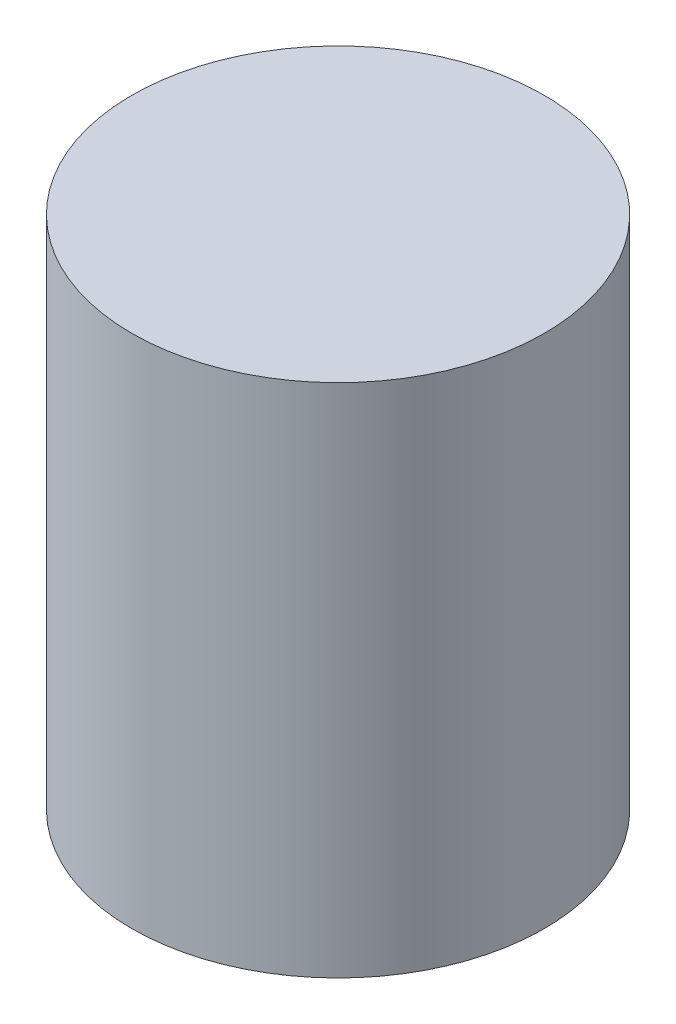
ISO-10303-21;
HEADER;
FILE_DESCRIPTION(('STEP AP214'),'2;1');
FILE_NAME('part.step','',(''),(''),'','','');
FILE_SCHEMA(('AUTOMOTIVE_DESIGN { 1 0 10303 214 1 1 1 1 }'));
ENDSEC;
DATA;
#1=APPLICATION_CONTEXT('core data for automotive mechanical design processes');
#2=APPLICATION_PROTOCOL_DEFINITION('international standard','automotive_design',2000,#1);
#3=PRODUCT_CONTEXT('',#1,'mechanical');
#4=PRODUCT('Part','Part','',(#3));
#5=PRODUCT_RELATED_PRODUCT_CATEGORY('part','',(#4));
#6=PRODUCT_DEFINITION_FORMATION('','',#4);
#7=PRODUCT_DEFINITION_CONTEXT('part definition',#1,'design');
#8=PRODUCT_DEFINITION('design','',#6,#7);
#9=PRODUCT_DEFINITION_SHAPE('','',#8);
#10=(LENGTH_UNIT() NAMED_UNIT(*) SI_UNIT(.MILLI.,.METRE.));
#11=(NAMED_UNIT(*) PLANE_ANGLE_UNIT() SI_UNIT($,.RADIAN.));
#12=(NAMED_UNIT(*) SI_UNIT($,.STERADIAN.) SOLID_ANGLE_UNIT());
#13=UNCERTAINTY_MEASURE_WITH_UNIT(LENGTH_MEASURE(1.E-05),#10,'distance_accuracy_value','');
#14=(GEOMETRIC_REPRESENTATION_CONTEXT(3) GLOBAL_UNCERTAINTY_ASSIGNED_CONTEXT((#13)) GLOBAL_UNIT_ASSIGNED_CONTEXT((#10,
#11,#12)) REPRESENTATION_CONTEXT('',''));
#15=CARTESIAN_POINT('',(0.,0.,0.));
#16=DIRECTION('',(0.,0.,1.));
#17=DIRECTION('',(1.,0.,0.));
#18=AXIS2_PLACEMENT_3D('',#15,#16,#17);
#19=CARTESIAN_POINT('',(0.,50.,0.));
#20=DIRECTION('',(0.,-1.,0.));
#21=DIRECTION('',(0.,0.,-1.));
#22=AXIS2_PLACEMENT_3D('',#19,#20,#21);
#23=CYLINDRICAL_SURFACE('',#22,20.);
#24=CARTESIAN_POINT('',(0.,50.,0.));
#25=DIRECTION('',(0.,1.,0.));
#26=DIRECTION('',(0.,0.,1.));
#27=AXIS2_PLACEMENT_3D('',#24,#25,#26);
#28=CIRCLE('',#27,20.);
#29=CARTESIAN_POINT('',(0.,50.,20.));
#30=VERTEX_POINT('',#29);
#31=EDGE_CURVE('E10',#30,#30,#28,.T.);
#32=ORIENTED_EDGE('',*,*,#31,.F.);
#33=EDGE_LOOP('',(#32));
#34=FACE_BOUND('',#33,.T.);
#35=CARTESIAN_POINT('',(0.,0.,0.));
#36=DIRECTION('',(0.,1.,0.));
#37=DIRECTION('',(0.,0.,1.));
#38=AXIS2_PLACEMENT_3D('',#35,#36,#37);
#39=CIRCLE('',#38,20.);
#40=CARTESIAN_POINT('',(0.,0.,20.));
#41=VERTEX_POINT('',#40);
#42=EDGE_CURVE('E42',#41,#41,#39,.T.);
#43=ORIENTED_EDGE('',*,*,#42,.T.);
#44=EDGE_LOOP('',(#43));
#45=FACE_BOUND('',#44,.T.);
#46=ADVANCED_FACE('F39',(#34,#45),#23,.T.);
#47=CARTESIAN_POINT('',(0.,50.,0.));
#48=DIRECTION('',(0.,1.,0.));
#49=DIRECTION('',(0.,0.,1.));
#50=AXIS2_PLACEMENT_3D('',#47,#48,#49);
#51=PLANE('',#50);
#52=ORIENTED_EDGE('',*,*,#31,.T.);
#53=EDGE_LOOP('',(#52));
#54=FACE_BOUND('',#53,.T.);
#55=ADVANCED_FACE('F56',(#54),#51,.T.);
#56=CARTESIAN_POINT('',(0.,0.,0.));
#57=DIRECTION('',(0.,1.,0.));
#58=DIRECTION('',(0.,0.,1.));
#59=AXIS2_PLACEMENT_3D('',#56,#57,#58);
#60=PLANE('',#59);
#61=ORIENTED_EDGE('',*,*,#42,.F.);
#62=EDGE_LOOP('',(#61));
#63=FACE_BOUND('',#62,.T.);
#64=ADVANCED_FACE('F54',(#63),#60,.F.);
#65=CLOSED_SHELL('',(#46,#55,#64));
#66=MANIFOLD_SOLID_BREP('B2',#65);
#67=ADVANCED_BREP_SHAPE_REPRESENTATION('',(#18,#66),#14);
#68=SHAPE_DEFINITION_REPRESENTATION(#9,#67);
ENDSEC;
END-ISO-10303-21;
